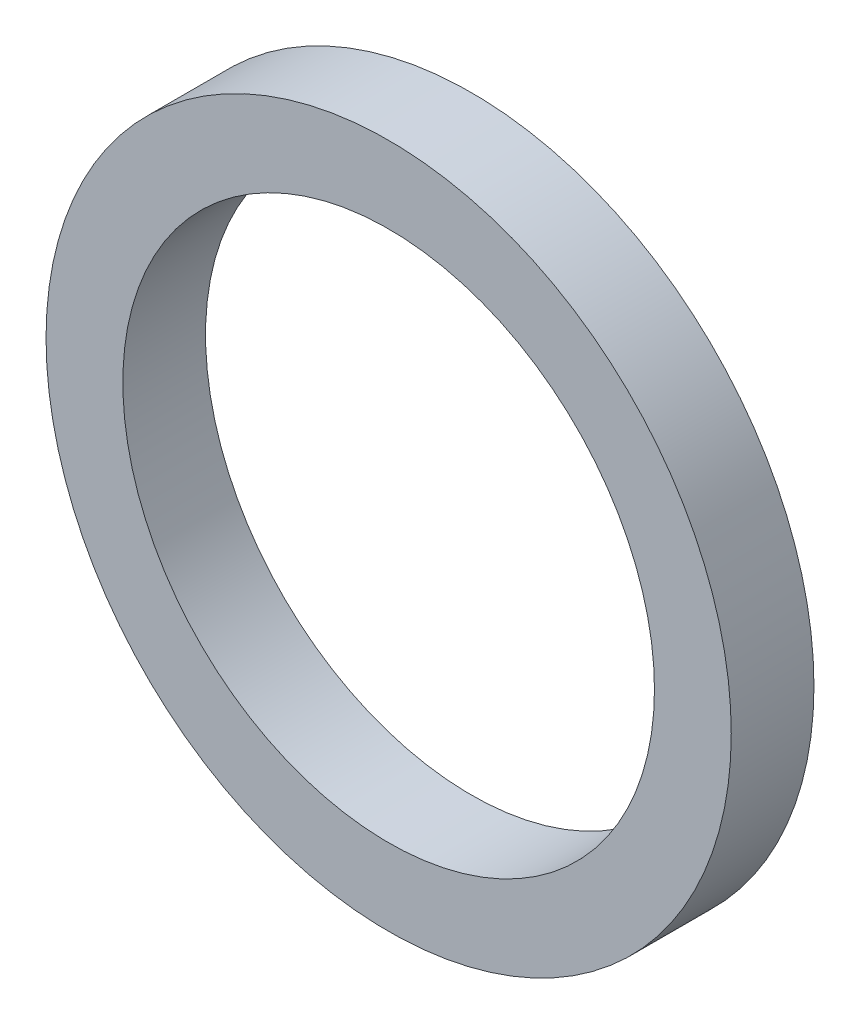
ISO-10303-21;
HEADER;
FILE_DESCRIPTION(('STEP AP214'),'2;1');
FILE_NAME('part.step','',(''),(''),'','','');
FILE_SCHEMA(('AUTOMOTIVE_DESIGN { 1 0 10303 214 1 1 1 1 }'));
ENDSEC;
DATA;
#1=APPLICATION_CONTEXT('core data for automotive mechanical design processes');
#2=APPLICATION_PROTOCOL_DEFINITION('international standard','automotive_design',2000,#1);
#3=PRODUCT_CONTEXT('',#1,'mechanical');
#4=PRODUCT('Part','Part','',(#3));
#5=PRODUCT_RELATED_PRODUCT_CATEGORY('part','',(#4));
#6=PRODUCT_DEFINITION_FORMATION('','',#4);
#7=PRODUCT_DEFINITION_CONTEXT('part definition',#1,'design');
#8=PRODUCT_DEFINITION('design','',#6,#7);
#9=PRODUCT_DEFINITION_SHAPE('','',#8);
#10=(LENGTH_UNIT() NAMED_UNIT(*) SI_UNIT(.MILLI.,.METRE.));
#11=(NAMED_UNIT(*) PLANE_ANGLE_UNIT() SI_UNIT($,.RADIAN.));
#12=(NAMED_UNIT(*) SI_UNIT($,.STERADIAN.) SOLID_ANGLE_UNIT());
#13=UNCERTAINTY_MEASURE_WITH_UNIT(LENGTH_MEASURE(1.E-05),#10,'distance_accuracy_value','');
#14=(GEOMETRIC_REPRESENTATION_CONTEXT(3) GLOBAL_UNCERTAINTY_ASSIGNED_CONTEXT((#13)) GLOBAL_UNIT_ASSIGNED_CONTEXT((#10,
#11,#12)) REPRESENTATION_CONTEXT('',''));
#15=CARTESIAN_POINT('',(0.,0.,0.));
#16=DIRECTION('',(0.,0.,1.));
#17=DIRECTION('',(1.,0.,0.));
#18=AXIS2_PLACEMENT_3D('',#15,#16,#17);
#19=CARTESIAN_POINT('',(0.,0.,0.));
#20=DIRECTION('',(0.,0.,1.));
#21=DIRECTION('',(1.,0.,0.));
#22=AXIS2_PLACEMENT_3D('',#19,#20,#21);
#23=PLANE('',#22);
#24=CARTESIAN_POINT('',(0.,0.,0.));
#25=DIRECTION('',(0.,0.,1.));
#26=DIRECTION('',(1.,0.,0.));
#27=AXIS2_PLACEMENT_3D('',#24,#25,#26);
#28=CIRCLE('',#27,22.5);
#29=CARTESIAN_POINT('',(22.5,0.,0.));
#30=VERTEX_POINT('',#29);
#31=EDGE_CURVE('E43',#30,#30,#28,.T.);
#32=ORIENTED_EDGE('',*,*,#31,.T.);
#33=EDGE_LOOP('',(#32));
#34=FACE_BOUND('',#33,.T.);
#35=CARTESIAN_POINT('',(0.,0.,0.));
#36=DIRECTION('',(0.,0.,1.));
#37=DIRECTION('',(1.,0.,0.));
#38=AXIS2_PLACEMENT_3D('',#35,#36,#37);
#39=CIRCLE('',#38,23.5);
#40=CARTESIAN_POINT('',(23.5,0.,0.));
#41=VERTEX_POINT('',#40);
#42=EDGE_CURVE('E49',#41,#41,#39,.T.);
#43=ORIENTED_EDGE('',*,*,#42,.F.);
#44=EDGE_LOOP('',(#43));
#45=FACE_BOUND('',#44,.T.);
#46=ADVANCED_FACE('F30',(#34,#45),#23,.F.);
#47=CARTESIAN_POINT('',(0.,0.,7.));
#48=DIRECTION('',(0.,0.,1.));
#49=DIRECTION('',(1.,0.,0.));
#50=AXIS2_PLACEMENT_3D('',#47,#48,#49);
#51=PLANE('',#50);
#52=CARTESIAN_POINT('',(0.,0.,7.));
#53=DIRECTION('',(0.,0.,1.));
#54=DIRECTION('',(1.,0.,0.));
#55=AXIS2_PLACEMENT_3D('',#52,#53,#54);
#56=CIRCLE('',#55,29.);
#57=CARTESIAN_POINT('',(29.,0.,7.));
#58=VERTEX_POINT('',#57);
#59=EDGE_CURVE('E10',#58,#58,#56,.T.);
#60=ORIENTED_EDGE('',*,*,#59,.T.);
#61=EDGE_LOOP('',(#60));
#62=FACE_BOUND('',#61,.T.);
#63=CARTESIAN_POINT('',(0.,0.,7.));
#64=DIRECTION('',(0.,0.,1.));
#65=DIRECTION('',(1.,0.,0.));
#66=AXIS2_PLACEMENT_3D('',#63,#64,#65);
#67=CIRCLE('',#66,22.5);
#68=CARTESIAN_POINT('',(22.5,0.,7.));
#69=VERTEX_POINT('',#68);
#70=EDGE_CURVE('E41',#69,#69,#67,.T.);
#71=ORIENTED_EDGE('',*,*,#70,.F.);
#72=EDGE_LOOP('',(#71));
#73=FACE_BOUND('',#72,.T.);
#74=ADVANCED_FACE('F78',(#62,#73),#51,.T.);
#75=CARTESIAN_POINT('',(0.,0.,0.));
#76=DIRECTION('',(0.,0.,1.));
#77=DIRECTION('',(1.,0.,0.));
#78=AXIS2_PLACEMENT_3D('',#75,#76,#77);
#79=CIRCLE('',#78,28.);
#80=CARTESIAN_POINT('',(28.,0.,0.));
#81=VERTEX_POINT('',#80);
#82=EDGE_CURVE('E53',#81,#81,#79,.T.);
#83=ORIENTED_EDGE('',*,*,#82,.T.);
#84=EDGE_LOOP('',(#83));
#85=FACE_BOUND('',#84,.T.);
#86=CARTESIAN_POINT('',(0.,0.,0.));
#87=DIRECTION('',(0.,0.,1.));
#88=DIRECTION('',(1.,0.,0.));
#89=AXIS2_PLACEMENT_3D('',#86,#87,#88);
#90=CIRCLE('',#89,29.);
#91=CARTESIAN_POINT('',(29.,0.,0.));
#92=VERTEX_POINT('',#91);
#93=EDGE_CURVE('E34',#92,#92,#90,.T.);
#94=ORIENTED_EDGE('',*,*,#93,.F.);
#95=EDGE_LOOP('',(#94));
#96=FACE_BOUND('',#95,.T.);
#97=ADVANCED_FACE('F80',(#85,#96),#23,.F.);
#98=CARTESIAN_POINT('',(0.,0.,7.));
#99=DIRECTION('',(0.,0.,-1.));
#100=DIRECTION('',(-1.,0.,0.));
#101=AXIS2_PLACEMENT_3D('',#98,#99,#100);
#102=CYLINDRICAL_SURFACE('',#101,29.);
#103=ORIENTED_EDGE('',*,*,#59,.F.);
#104=EDGE_LOOP('',(#103));
#105=FACE_BOUND('',#104,.T.);
#106=ORIENTED_EDGE('',*,*,#93,.T.);
#107=EDGE_LOOP('',(#106));
#108=FACE_BOUND('',#107,.T.);
#109=ADVANCED_FACE('F32',(#105,#108),#102,.T.);
#110=CARTESIAN_POINT('',(0.,0.,7.));
#111=DIRECTION('',(0.,0.,-1.));
#112=DIRECTION('',(-1.,0.,0.));
#113=AXIS2_PLACEMENT_3D('',#110,#111,#112);
#114=CYLINDRICAL_SURFACE('',#113,22.5);
#115=ORIENTED_EDGE('',*,*,#70,.T.);
#116=EDGE_LOOP('',(#115));
#117=FACE_BOUND('',#116,.T.);
#118=ORIENTED_EDGE('',*,*,#31,.F.);
#119=EDGE_LOOP('',(#118));
#120=FACE_BOUND('',#119,.T.);
#121=ADVANCED_FACE('F67',(#117,#120),#114,.F.);
#122=CARTESIAN_POINT('',(0.,0.,6.));
#123=DIRECTION('',(0.,0.,1.));
#124=DIRECTION('',(1.,0.,0.));
#125=AXIS2_PLACEMENT_3D('',#122,#123,#124);
#126=PLANE('',#125);
#127=CARTESIAN_POINT('',(0.,0.,6.));
#128=DIRECTION('',(0.,0.,1.));
#129=DIRECTION('',(1.,0.,0.));
#130=AXIS2_PLACEMENT_3D('',#127,#128,#129);
#131=CIRCLE('',#130,28.);
#132=CARTESIAN_POINT('',(28.,0.,6.));
#133=VERTEX_POINT('',#132);
#134=EDGE_CURVE('E46',#133,#133,#131,.T.);
#135=ORIENTED_EDGE('',*,*,#134,.F.);
#136=EDGE_LOOP('',(#135));
#137=FACE_BOUND('',#136,.T.);
#138=CARTESIAN_POINT('',(0.,0.,6.));
#139=DIRECTION('',(0.,0.,1.));
#140=DIRECTION('',(1.,0.,0.));
#141=AXIS2_PLACEMENT_3D('',#138,#139,#140);
#142=CIRCLE('',#141,23.5);
#143=CARTESIAN_POINT('',(23.5,0.,6.));
#144=VERTEX_POINT('',#143);
#145=EDGE_CURVE('E52',#144,#144,#142,.T.);
#146=ORIENTED_EDGE('',*,*,#145,.T.);
#147=EDGE_LOOP('',(#146));
#148=FACE_BOUND('',#147,.T.);
#149=ADVANCED_FACE('F64',(#137,#148),#126,.F.);
#150=CARTESIAN_POINT('',(0.,0.,7.));
#151=DIRECTION('',(0.,0.,-1.));
#152=DIRECTION('',(-1.,0.,0.));
#153=AXIS2_PLACEMENT_3D('',#150,#151,#152);
#154=CYLINDRICAL_SURFACE('',#153,28.);
#155=ORIENTED_EDGE('',*,*,#134,.T.);
#156=EDGE_LOOP('',(#155));
#157=FACE_BOUND('',#156,.T.);
#158=ORIENTED_EDGE('',*,*,#82,.F.);
#159=EDGE_LOOP('',(#158));
#160=FACE_BOUND('',#159,.T.);
#161=ADVANCED_FACE('F61',(#157,#160),#154,.F.);
#162=CARTESIAN_POINT('',(0.,0.,7.));
#163=DIRECTION('',(0.,0.,-1.));
#164=DIRECTION('',(-1.,0.,0.));
#165=AXIS2_PLACEMENT_3D('',#162,#163,#164);
#166=CYLINDRICAL_SURFACE('',#165,23.5);
#167=ORIENTED_EDGE('',*,*,#145,.F.);
#168=EDGE_LOOP('',(#167));
#169=FACE_BOUND('',#168,.T.);
#170=ORIENTED_EDGE('',*,*,#42,.T.);
#171=EDGE_LOOP('',(#170));
#172=FACE_BOUND('',#171,.T.);
#173=ADVANCED_FACE('F71',(#169,#172),#166,.T.);
#174=CLOSED_SHELL('',(#46,#74,#97,#109,#121,#149,#161,#173));
#175=MANIFOLD_SOLID_BREP('B2',#174);
#176=ADVANCED_BREP_SHAPE_REPRESENTATION('',(#18,#175),#14);
#177=SHAPE_DEFINITION_REPRESENTATION(#9,#176);
ENDSEC;
END-ISO-10303-21;
